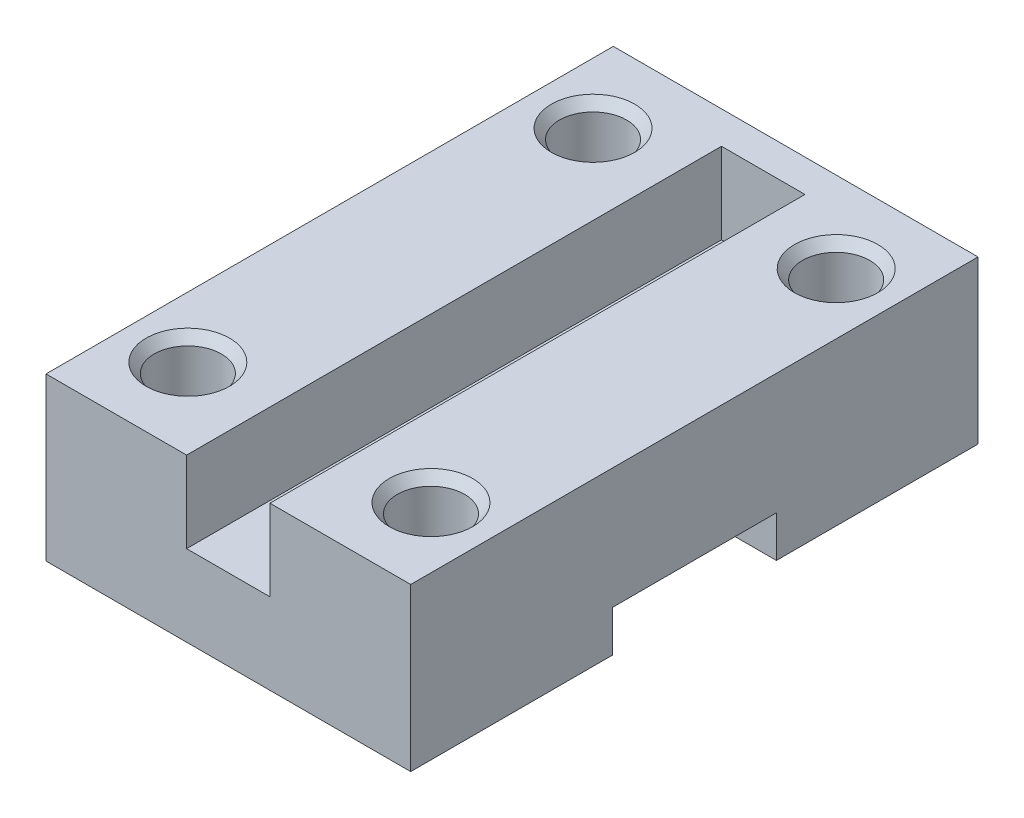
ISO-10303-21;
HEADER;
FILE_DESCRIPTION(('STEP AP214'),'2;1');
FILE_NAME('part.step','',(''),(''),'','','');
FILE_SCHEMA(('AUTOMOTIVE_DESIGN { 1 0 10303 214 1 1 1 1 }'));
ENDSEC;
DATA;
#1=APPLICATION_CONTEXT('core data for automotive mechanical design processes');
#2=APPLICATION_PROTOCOL_DEFINITION('international standard','automotive_design',2000,#1);
#3=PRODUCT_CONTEXT('',#1,'mechanical');
#4=PRODUCT('Part','Part','',(#3));
#5=PRODUCT_RELATED_PRODUCT_CATEGORY('part','',(#4));
#6=PRODUCT_DEFINITION_FORMATION('','',#4);
#7=PRODUCT_DEFINITION_CONTEXT('part definition',#1,'design');
#8=PRODUCT_DEFINITION('design','',#6,#7);
#9=PRODUCT_DEFINITION_SHAPE('','',#8);
#10=(LENGTH_UNIT() NAMED_UNIT(*) SI_UNIT(.MILLI.,.METRE.));
#11=(NAMED_UNIT(*) PLANE_ANGLE_UNIT() SI_UNIT($,.RADIAN.));
#12=(NAMED_UNIT(*) SI_UNIT($,.STERADIAN.) SOLID_ANGLE_UNIT());
#13=UNCERTAINTY_MEASURE_WITH_UNIT(LENGTH_MEASURE(1.E-05),#10,'distance_accuracy_value','');
#14=(GEOMETRIC_REPRESENTATION_CONTEXT(3) GLOBAL_UNCERTAINTY_ASSIGNED_CONTEXT((#13)) GLOBAL_UNIT_ASSIGNED_CONTEXT((#10,
#11,#12)) REPRESENTATION_CONTEXT('',''));
#15=CARTESIAN_POINT('',(0.,0.,0.));
#16=DIRECTION('',(0.,0.,1.));
#17=DIRECTION('',(1.,0.,0.));
#18=AXIS2_PLACEMENT_3D('',#15,#16,#17);
#19=CARTESIAN_POINT('',(0.,0.,0.));
#20=DIRECTION('',(0.,1.,0.));
#21=DIRECTION('',(0.,0.,1.));
#22=AXIS2_PLACEMENT_3D('',#19,#20,#21);
#23=PLANE('',#22);
#24=CARTESIAN_POINT('',(-15.,0.,25.));
#25=DIRECTION('',(0.,-1.,0.));
#26=DIRECTION('',(0.,0.,-1.));
#27=AXIS2_PLACEMENT_3D('',#24,#25,#26);
#28=CIRCLE('',#27,4.15);
#29=CARTESIAN_POINT('',(-15.,0.,20.85));
#30=VERTEX_POINT('',#29);
#31=EDGE_CURVE('E193',#30,#30,#28,.T.);
#32=ORIENTED_EDGE('',*,*,#31,.F.);
#33=EDGE_LOOP('',(#32));
#34=FACE_BOUND('',#33,.T.);
#35=CARTESIAN_POINT('',(15.,0.,25.));
#36=DIRECTION('',(0.,-1.,0.));
#37=DIRECTION('',(0.,0.,-1.));
#38=AXIS2_PLACEMENT_3D('',#35,#36,#37);
#39=CIRCLE('',#38,4.15);
#40=CARTESIAN_POINT('',(15.,0.,20.85));
#41=VERTEX_POINT('',#40);
#42=EDGE_CURVE('E197',#41,#41,#39,.T.);
#43=ORIENTED_EDGE('',*,*,#42,.F.);
#44=EDGE_LOOP('',(#43));
#45=FACE_BOUND('',#44,.T.);
#46=DIRECTION('',(0.,0.,1.));
#47=VECTOR('',#46,1.);
#48=CARTESIAN_POINT('',(-22.5,0.,35.));
#49=LINE('',#48,#47);
#50=CARTESIAN_POINT('',(-22.5,0.,10.125));
#51=VERTEX_POINT('',#50);
#52=CARTESIAN_POINT('',(-22.5,0.,35.));
#53=VERTEX_POINT('',#52);
#54=EDGE_CURVE('E229',#51,#53,#49,.T.);
#55=ORIENTED_EDGE('',*,*,#54,.F.);
#56=DIRECTION('',(1.,0.,0.));
#57=VECTOR('',#56,1.);
#58=CARTESIAN_POINT('',(-22.5,0.,10.125));
#59=LINE('',#58,#57);
#60=CARTESIAN_POINT('',(22.5,0.,10.125));
#61=VERTEX_POINT('',#60);
#62=EDGE_CURVE('E212',#51,#61,#59,.T.);
#63=ORIENTED_EDGE('',*,*,#62,.T.);
#64=DIRECTION('',(0.,0.,-1.));
#65=VECTOR('',#64,1.);
#66=CARTESIAN_POINT('',(22.5,0.,35.));
#67=LINE('',#66,#65);
#68=CARTESIAN_POINT('',(22.5,0.,35.));
#69=VERTEX_POINT('',#68);
#70=EDGE_CURVE('E236',#69,#61,#67,.T.);
#71=ORIENTED_EDGE('',*,*,#70,.F.);
#72=DIRECTION('',(1.,0.,0.));
#73=VECTOR('',#72,1.);
#74=CARTESIAN_POINT('',(22.5,0.,35.));
#75=LINE('',#74,#73);
#76=EDGE_CURVE('E233',#53,#69,#75,.T.);
#77=ORIENTED_EDGE('',*,*,#76,.F.);
#78=EDGE_LOOP('',(#55,#63,#71,#77));
#79=FACE_BOUND('',#78,.T.);
#80=ADVANCED_FACE('F34',(#34,#45,#79),#23,.F.);
#81=CARTESIAN_POINT('',(-22.5,10.,35.));
#82=DIRECTION('',(1.,0.,0.));
#83=DIRECTION('',(0.,0.,-1.));
#84=AXIS2_PLACEMENT_3D('',#81,#82,#83);
#85=PLANE('',#84);
#86=DIRECTION('',(0.,0.,1.));
#87=VECTOR('',#86,1.);
#88=CARTESIAN_POINT('',(-22.5,5.10000000000001,-10.125));
#89=LINE('',#88,#87);
#90=CARTESIAN_POINT('',(-22.5,5.10000000000001,-10.125));
#91=VERTEX_POINT('',#90);
#92=CARTESIAN_POINT('',(-22.5,5.1,10.125));
#93=VERTEX_POINT('',#92);
#94=EDGE_CURVE('E210',#91,#93,#89,.T.);
#95=ORIENTED_EDGE('',*,*,#94,.T.);
#96=DIRECTION('',(0.,-1.,0.));
#97=VECTOR('',#96,1.);
#98=CARTESIAN_POINT('',(-22.5,5.1,10.125));
#99=LINE('',#98,#97);
#100=EDGE_CURVE('E204',#93,#51,#99,.T.);
#101=ORIENTED_EDGE('',*,*,#100,.T.);
#102=ORIENTED_EDGE('',*,*,#54,.T.);
#103=DIRECTION('',(0.,-1.,0.));
#104=VECTOR('',#103,1.);
#105=CARTESIAN_POINT('',(-22.5,10.,35.));
#106=LINE('',#105,#104);
#107=CARTESIAN_POINT('',(-22.5,20.,35.));
#108=VERTEX_POINT('',#107);
#109=EDGE_CURVE('E146',#108,#53,#106,.T.);
#110=ORIENTED_EDGE('',*,*,#109,.F.);
#111=DIRECTION('',(0.,0.,1.));
#112=VECTOR('',#111,1.);
#113=CARTESIAN_POINT('',(-22.5,20.,35.));
#114=LINE('',#113,#112);
#115=CARTESIAN_POINT('',(-22.5,20.,-35.));
#116=VERTEX_POINT('',#115);
#117=EDGE_CURVE('E142',#116,#108,#114,.T.);
#118=ORIENTED_EDGE('',*,*,#117,.F.);
#119=DIRECTION('',(0.,-1.,0.));
#120=VECTOR('',#119,1.);
#121=CARTESIAN_POINT('',(-22.5,10.,-35.));
#122=LINE('',#121,#120);
#123=CARTESIAN_POINT('',(-22.5,0.,-35.));
#124=VERTEX_POINT('',#123);
#125=EDGE_CURVE('E127',#116,#124,#122,.T.);
#126=ORIENTED_EDGE('',*,*,#125,.T.);
#127=CARTESIAN_POINT('',(-22.5,0.,-10.125));
#128=VERTEX_POINT('',#127);
#129=EDGE_CURVE('E231',#124,#128,#49,.T.);
#130=ORIENTED_EDGE('',*,*,#129,.T.);
#131=DIRECTION('',(0.,1.,0.));
#132=VECTOR('',#131,1.);
#133=CARTESIAN_POINT('',(-22.5,5.10000000000001,-10.125));
#134=LINE('',#133,#132);
#135=EDGE_CURVE('E207',#128,#91,#134,.T.);
#136=ORIENTED_EDGE('',*,*,#135,.T.);
#137=EDGE_LOOP('',(#95,#101,#102,#110,#118,#126,#130,#136));
#138=FACE_BOUND('',#137,.T.);
#139=ADVANCED_FACE('F144',(#138),#85,.F.);
#140=CARTESIAN_POINT('',(22.5,10.,35.));
#141=DIRECTION('',(0.,0.,-1.));
#142=DIRECTION('',(-1.,0.,0.));
#143=AXIS2_PLACEMENT_3D('',#140,#141,#142);
#144=PLANE('',#143);
#145=ORIENTED_EDGE('',*,*,#76,.T.);
#146=DIRECTION('',(0.,-1.,0.));
#147=VECTOR('',#146,1.);
#148=CARTESIAN_POINT('',(22.5,10.,35.));
#149=LINE('',#148,#147);
#150=CARTESIAN_POINT('',(22.5,20.,35.));
#151=VERTEX_POINT('',#150);
#152=EDGE_CURVE('E241',#151,#69,#149,.T.);
#153=ORIENTED_EDGE('',*,*,#152,.F.);
#154=DIRECTION('',(1.,0.,0.));
#155=VECTOR('',#154,1.);
#156=CARTESIAN_POINT('',(5.15,20.,35.));
#157=LINE('',#156,#155);
#158=CARTESIAN_POINT('',(5.15,20.,35.));
#159=VERTEX_POINT('',#158);
#160=EDGE_CURVE('E168',#159,#151,#157,.T.);
#161=ORIENTED_EDGE('',*,*,#160,.F.);
#162=DIRECTION('',(0.,-1.,0.));
#163=VECTOR('',#162,1.);
#164=CARTESIAN_POINT('',(5.15,20.,35.));
#165=LINE('',#164,#163);
#166=CARTESIAN_POINT('',(5.15,10.,35.));
#167=VERTEX_POINT('',#166);
#168=EDGE_CURVE('E171',#159,#167,#165,.T.);
#169=ORIENTED_EDGE('',*,*,#168,.T.);
#170=DIRECTION('',(1.,0.,0.));
#171=VECTOR('',#170,1.);
#172=CARTESIAN_POINT('',(22.5,10.,35.));
#173=LINE('',#172,#171);
#174=CARTESIAN_POINT('',(-5.15,10.,35.));
#175=VERTEX_POINT('',#174);
#176=EDGE_CURVE('E139',#175,#167,#173,.T.);
#177=ORIENTED_EDGE('',*,*,#176,.F.);
#178=DIRECTION('',(0.,-1.,0.));
#179=VECTOR('',#178,1.);
#180=CARTESIAN_POINT('',(-5.15,20.,35.));
#181=LINE('',#180,#179);
#182=CARTESIAN_POINT('',(-5.15,20.,35.));
#183=VERTEX_POINT('',#182);
#184=EDGE_CURVE('E189',#183,#175,#181,.T.);
#185=ORIENTED_EDGE('',*,*,#184,.F.);
#186=DIRECTION('',(1.,0.,0.));
#187=VECTOR('',#186,1.);
#188=CARTESIAN_POINT('',(-5.15,20.,35.));
#189=LINE('',#188,#187);
#190=EDGE_CURVE('E149',#108,#183,#189,.T.);
#191=ORIENTED_EDGE('',*,*,#190,.F.);
#192=ORIENTED_EDGE('',*,*,#109,.T.);
#193=EDGE_LOOP('',(#145,#153,#161,#169,#177,#185,#191,#192));
#194=FACE_BOUND('',#193,.T.);
#195=ADVANCED_FACE('F291',(#194),#144,.F.);
#196=CARTESIAN_POINT('',(22.5,10.,35.));
#197=DIRECTION('',(-1.,0.,0.));
#198=DIRECTION('',(0.,0.,1.));
#199=AXIS2_PLACEMENT_3D('',#196,#197,#198);
#200=PLANE('',#199);
#201=ORIENTED_EDGE('',*,*,#70,.T.);
#202=DIRECTION('',(0.,1.,0.));
#203=VECTOR('',#202,1.);
#204=CARTESIAN_POINT('',(22.5,10.,10.125));
#205=LINE('',#204,#203);
#206=CARTESIAN_POINT('',(22.5,5.1,10.125));
#207=VERTEX_POINT('',#206);
#208=EDGE_CURVE('E226',#61,#207,#205,.T.);
#209=ORIENTED_EDGE('',*,*,#208,.T.);
#210=DIRECTION('',(0.,0.,-1.));
#211=VECTOR('',#210,1.);
#212=CARTESIAN_POINT('',(22.5,5.1,35.));
#213=LINE('',#212,#211);
#214=CARTESIAN_POINT('',(22.5,5.10000000000001,-10.125));
#215=VERTEX_POINT('',#214);
#216=EDGE_CURVE('E245',#207,#215,#213,.T.);
#217=ORIENTED_EDGE('',*,*,#216,.T.);
#218=DIRECTION('',(0.,-1.,0.));
#219=VECTOR('',#218,1.);
#220=CARTESIAN_POINT('',(22.5,9.99999999999997,-10.125));
#221=LINE('',#220,#219);
#222=CARTESIAN_POINT('',(22.5,0.,-10.125));
#223=VERTEX_POINT('',#222);
#224=EDGE_CURVE('E216',#215,#223,#221,.T.);
#225=ORIENTED_EDGE('',*,*,#224,.T.);
#226=CARTESIAN_POINT('',(22.5,0.,-35.));
#227=VERTEX_POINT('',#226);
#228=EDGE_CURVE('E235',#223,#227,#67,.T.);
#229=ORIENTED_EDGE('',*,*,#228,.T.);
#230=DIRECTION('',(0.,-1.,0.));
#231=VECTOR('',#230,1.);
#232=CARTESIAN_POINT('',(22.5,10.,-35.));
#233=LINE('',#232,#231);
#234=CARTESIAN_POINT('',(22.5,20.,-35.));
#235=VERTEX_POINT('',#234);
#236=EDGE_CURVE('E138',#235,#227,#233,.T.);
#237=ORIENTED_EDGE('',*,*,#236,.F.);
#238=DIRECTION('',(0.,0.,-1.));
#239=VECTOR('',#238,1.);
#240=CARTESIAN_POINT('',(22.5,20.,35.));
#241=LINE('',#240,#239);
#242=EDGE_CURVE('E155',#151,#235,#241,.T.);
#243=ORIENTED_EDGE('',*,*,#242,.F.);
#244=ORIENTED_EDGE('',*,*,#152,.T.);
#245=EDGE_LOOP('',(#201,#209,#217,#225,#229,#237,#243,#244));
#246=FACE_BOUND('',#245,.T.);
#247=ADVANCED_FACE('F315',(#246),#200,.F.);
#248=CARTESIAN_POINT('',(22.5,10.,-35.));
#249=DIRECTION('',(0.,0.,1.));
#250=DIRECTION('',(1.,0.,0.));
#251=AXIS2_PLACEMENT_3D('',#248,#249,#250);
#252=PLANE('',#251);
#253=DIRECTION('',(-1.,0.,0.));
#254=VECTOR('',#253,1.);
#255=CARTESIAN_POINT('',(22.5,0.,-35.));
#256=LINE('',#255,#254);
#257=EDGE_CURVE('E134',#227,#124,#256,.T.);
#258=ORIENTED_EDGE('',*,*,#257,.T.);
#259=ORIENTED_EDGE('',*,*,#125,.F.);
#260=DIRECTION('',(-1.,0.,0.));
#261=VECTOR('',#260,1.);
#262=CARTESIAN_POINT('',(-22.5,20.,-35.));
#263=LINE('',#262,#261);
#264=EDGE_CURVE('E132',#235,#116,#263,.T.);
#265=ORIENTED_EDGE('',*,*,#264,.F.);
#266=ORIENTED_EDGE('',*,*,#236,.T.);
#267=EDGE_LOOP('',(#258,#259,#265,#266));
#268=FACE_BOUND('',#267,.T.);
#269=ADVANCED_FACE('F129',(#268),#252,.F.);
#270=CARTESIAN_POINT('',(0.,10.,0.));
#271=DIRECTION('',(0.,1.,0.));
#272=DIRECTION('',(0.,0.,1.));
#273=AXIS2_PLACEMENT_3D('',#270,#271,#272);
#274=PLANE('',#273);
#275=DIRECTION('',(0.363344208928321,0.,0.93165497145577));
#276=VECTOR('',#275,1.);
#277=CARTESIAN_POINT('',(5.15,10.,35.));
#278=LINE('',#277,#276);
#279=CARTESIAN_POINT('',(5.13022934751461,10.,34.9493058476664));
#280=VERTEX_POINT('',#279);
#281=EDGE_CURVE('E49',#280,#167,#278,.T.);
#282=ORIENTED_EDGE('',*,*,#281,.F.);
#283=DIRECTION('',(-0.000299785590505607,0.,0.999999955064299));
#284=VECTOR('',#283,1.);
#285=CARTESIAN_POINT('',(5.15,10.,-31.));
#286=LINE('',#285,#284);
#287=CARTESIAN_POINT('',(5.15,10.,-31.));
#288=VERTEX_POINT('',#287);
#289=EDGE_CURVE('E53',#288,#280,#286,.T.);
#290=ORIENTED_EDGE('',*,*,#289,.F.);
#291=DIRECTION('',(1.,0.,0.));
#292=VECTOR('',#291,1.);
#293=CARTESIAN_POINT('',(-5.15,10.,-31.));
#294=LINE('',#293,#292);
#295=CARTESIAN_POINT('',(-5.15,10.,-31.));
#296=VERTEX_POINT('',#295);
#297=EDGE_CURVE('E175',#296,#288,#294,.T.);
#298=ORIENTED_EDGE('',*,*,#297,.F.);
#299=DIRECTION('',(0.,0.,-1.));
#300=VECTOR('',#299,1.);
#301=CARTESIAN_POINT('',(-5.15,10.,35.));
#302=LINE('',#301,#300);
#303=EDGE_CURVE('E172',#175,#296,#302,.T.);
#304=ORIENTED_EDGE('',*,*,#303,.F.);
#305=ORIENTED_EDGE('',*,*,#176,.T.);
#306=EDGE_LOOP('',(#282,#290,#298,#304,#305));
#307=FACE_BOUND('',#306,.T.);
#308=ADVANCED_FACE('F299',(#307),#274,.T.);
#309=CARTESIAN_POINT('',(15.,0.,-25.));
#310=DIRECTION('',(0.,-1.,0.));
#311=DIRECTION('',(0.,0.,-1.));
#312=AXIS2_PLACEMENT_3D('',#309,#310,#311);
#313=CIRCLE('',#312,4.15);
#314=CARTESIAN_POINT('',(15.,0.,-29.15));
#315=VERTEX_POINT('',#314);
#316=EDGE_CURVE('E192',#315,#315,#313,.T.);
#317=ORIENTED_EDGE('',*,*,#316,.F.);
#318=EDGE_LOOP('',(#317));
#319=FACE_BOUND('',#318,.T.);
#320=CARTESIAN_POINT('',(-15.,0.,-25.));
#321=DIRECTION('',(0.,-1.,0.));
#322=DIRECTION('',(0.,0.,-1.));
#323=AXIS2_PLACEMENT_3D('',#320,#321,#322);
#324=CIRCLE('',#323,4.15);
#325=CARTESIAN_POINT('',(-15.,0.,-29.15));
#326=VERTEX_POINT('',#325);
#327=EDGE_CURVE('E196',#326,#326,#324,.T.);
#328=ORIENTED_EDGE('',*,*,#327,.F.);
#329=EDGE_LOOP('',(#328));
#330=FACE_BOUND('',#329,.T.);
#331=ORIENTED_EDGE('',*,*,#228,.F.);
#332=DIRECTION('',(1.,0.,0.));
#333=VECTOR('',#332,1.);
#334=CARTESIAN_POINT('',(-22.5,0.,-10.125));
#335=LINE('',#334,#333);
#336=EDGE_CURVE('E220',#128,#223,#335,.T.);
#337=ORIENTED_EDGE('',*,*,#336,.F.);
#338=ORIENTED_EDGE('',*,*,#129,.F.);
#339=ORIENTED_EDGE('',*,*,#257,.F.);
#340=EDGE_LOOP('',(#331,#337,#338,#339));
#341=FACE_BOUND('',#340,.T.);
#342=ADVANCED_FACE('F287',(#319,#330,#341),#23,.F.);
#343=CARTESIAN_POINT('',(-22.5,5.10000000000001,-10.125));
#344=DIRECTION('',(0.,1.,0.));
#345=DIRECTION('',(0.,0.,1.));
#346=AXIS2_PLACEMENT_3D('',#343,#344,#345);
#347=PLANE('',#346);
#348=DIRECTION('',(1.,0.,0.));
#349=VECTOR('',#348,1.);
#350=CARTESIAN_POINT('',(-22.5,5.1,10.125));
#351=LINE('',#350,#349);
#352=EDGE_CURVE('E213',#93,#207,#351,.T.);
#353=ORIENTED_EDGE('',*,*,#352,.F.);
#354=ORIENTED_EDGE('',*,*,#94,.F.);
#355=DIRECTION('',(1.,0.,0.));
#356=VECTOR('',#355,1.);
#357=CARTESIAN_POINT('',(-22.5,5.10000000000001,-10.125));
#358=LINE('',#357,#356);
#359=EDGE_CURVE('E217',#91,#215,#358,.T.);
#360=ORIENTED_EDGE('',*,*,#359,.T.);
#361=ORIENTED_EDGE('',*,*,#216,.F.);
#362=EDGE_LOOP('',(#353,#354,#360,#361));
#363=FACE_BOUND('',#362,.T.);
#364=ADVANCED_FACE('F298',(#363),#347,.F.);
#365=CARTESIAN_POINT('',(-22.5,5.1,10.125));
#366=DIRECTION('',(0.,0.,1.));
#367=DIRECTION('',(1.,0.,0.));
#368=AXIS2_PLACEMENT_3D('',#365,#366,#367);
#369=PLANE('',#368);
#370=ORIENTED_EDGE('',*,*,#62,.F.);
#371=ORIENTED_EDGE('',*,*,#100,.F.);
#372=ORIENTED_EDGE('',*,*,#352,.T.);
#373=ORIENTED_EDGE('',*,*,#208,.F.);
#374=EDGE_LOOP('',(#370,#371,#372,#373));
#375=FACE_BOUND('',#374,.T.);
#376=ADVANCED_FACE('F305',(#375),#369,.F.);
#377=CARTESIAN_POINT('',(-22.5,5.10000000000001,-10.125));
#378=DIRECTION('',(0.,0.,-1.));
#379=DIRECTION('',(0.,1.,0.));
#380=AXIS2_PLACEMENT_3D('',#377,#378,#379);
#381=PLANE('',#380);
#382=ORIENTED_EDGE('',*,*,#359,.F.);
#383=ORIENTED_EDGE('',*,*,#135,.F.);
#384=ORIENTED_EDGE('',*,*,#336,.T.);
#385=ORIENTED_EDGE('',*,*,#224,.F.);
#386=EDGE_LOOP('',(#382,#383,#384,#385));
#387=FACE_BOUND('',#386,.T.);
#388=ADVANCED_FACE('F317',(#387),#381,.F.);
#389=CARTESIAN_POINT('',(-15.,10.,-25.));
#390=DIRECTION('',(0.,-1.,0.));
#391=DIRECTION('',(0.,0.,-1.));
#392=AXIS2_PLACEMENT_3D('',#389,#390,#391);
#393=CYLINDRICAL_SURFACE('',#392,4.15);
#394=CARTESIAN_POINT('',(-15.,18.8082464074058,-25.));
#395=DIRECTION('',(0.,1.,0.));
#396=DIRECTION('',(0.,0.,1.));
#397=AXIS2_PLACEMENT_3D('',#394,#395,#396);
#398=CIRCLE('',#397,4.15);
#399=CARTESIAN_POINT('',(-15.,18.8082464074058,-20.85));
#400=VERTEX_POINT('',#399);
#401=EDGE_CURVE('E42',#400,#400,#398,.T.);
#402=ORIENTED_EDGE('',*,*,#401,.T.);
#403=EDGE_LOOP('',(#402));
#404=FACE_BOUND('',#403,.T.);
#405=ORIENTED_EDGE('',*,*,#327,.T.);
#406=EDGE_LOOP('',(#405));
#407=FACE_BOUND('',#406,.T.);
#408=ADVANCED_FACE('F268',(#404,#407),#393,.F.);
#409=CARTESIAN_POINT('',(15.,10.,-25.));
#410=DIRECTION('',(0.,-1.,0.));
#411=DIRECTION('',(0.,0.,-1.));
#412=AXIS2_PLACEMENT_3D('',#409,#410,#411);
#413=CYLINDRICAL_SURFACE('',#412,4.15);
#414=CARTESIAN_POINT('',(15.,18.8082464074058,-25.));
#415=DIRECTION('',(0.,1.,0.));
#416=DIRECTION('',(0.,0.,1.));
#417=AXIS2_PLACEMENT_3D('',#414,#415,#416);
#418=CIRCLE('',#417,4.15);
#419=CARTESIAN_POINT('',(15.,18.8082464074058,-20.85));
#420=VERTEX_POINT('',#419);
#421=EDGE_CURVE('E11',#420,#420,#418,.T.);
#422=ORIENTED_EDGE('',*,*,#421,.T.);
#423=EDGE_LOOP('',(#422));
#424=FACE_BOUND('',#423,.T.);
#425=ORIENTED_EDGE('',*,*,#316,.T.);
#426=EDGE_LOOP('',(#425));
#427=FACE_BOUND('',#426,.T.);
#428=ADVANCED_FACE('F354',(#424,#427),#413,.F.);
#429=CARTESIAN_POINT('',(15.,10.,25.));
#430=DIRECTION('',(0.,-1.,0.));
#431=DIRECTION('',(0.,0.,-1.));
#432=AXIS2_PLACEMENT_3D('',#429,#430,#431);
#433=CYLINDRICAL_SURFACE('',#432,4.15);
#434=CARTESIAN_POINT('',(15.,18.8082464074058,25.));
#435=DIRECTION('',(0.,1.,0.));
#436=DIRECTION('',(0.,0.,1.));
#437=AXIS2_PLACEMENT_3D('',#434,#435,#436);
#438=CIRCLE('',#437,4.15);
#439=CARTESIAN_POINT('',(15.,18.8082464074058,29.15));
#440=VERTEX_POINT('',#439);
#441=EDGE_CURVE('E248',#440,#440,#438,.T.);
#442=ORIENTED_EDGE('',*,*,#441,.T.);
#443=EDGE_LOOP('',(#442));
#444=FACE_BOUND('',#443,.T.);
#445=ORIENTED_EDGE('',*,*,#42,.T.);
#446=EDGE_LOOP('',(#445));
#447=FACE_BOUND('',#446,.T.);
#448=ADVANCED_FACE('F357',(#444,#447),#433,.F.);
#449=CARTESIAN_POINT('',(-15.,10.,25.));
#450=DIRECTION('',(0.,-1.,0.));
#451=DIRECTION('',(0.,0.,-1.));
#452=AXIS2_PLACEMENT_3D('',#449,#450,#451);
#453=CYLINDRICAL_SURFACE('',#452,4.15);
#454=CARTESIAN_POINT('',(-15.,18.8082464074058,25.));
#455=DIRECTION('',(0.,1.,0.));
#456=DIRECTION('',(0.,0.,1.));
#457=AXIS2_PLACEMENT_3D('',#454,#455,#456);
#458=CIRCLE('',#457,4.15);
#459=CARTESIAN_POINT('',(-15.,18.8082464074058,29.15));
#460=VERTEX_POINT('',#459);
#461=EDGE_CURVE('E263',#460,#460,#458,.T.);
#462=ORIENTED_EDGE('',*,*,#461,.T.);
#463=EDGE_LOOP('',(#462));
#464=FACE_BOUND('',#463,.T.);
#465=ORIENTED_EDGE('',*,*,#31,.T.);
#466=EDGE_LOOP('',(#465));
#467=FACE_BOUND('',#466,.T.);
#468=ADVANCED_FACE('F361',(#464,#467),#453,.F.);
#469=CARTESIAN_POINT('',(0.,20.,0.));
#470=DIRECTION('',(0.,1.,0.));
#471=DIRECTION('',(0.,0.,1.));
#472=AXIS2_PLACEMENT_3D('',#469,#470,#471);
#473=PLANE('',#472);
#474=CARTESIAN_POINT('',(15.,20.,25.));
#475=DIRECTION('',(0.,1.,0.));
#476=DIRECTION('',(0.,0.,1.));
#477=AXIS2_PLACEMENT_3D('',#474,#475,#476);
#478=CIRCLE('',#477,5.15000000000002);
#479=CARTESIAN_POINT('',(15.,20.,30.15));
#480=VERTEX_POINT('',#479);
#481=EDGE_CURVE('E260',#480,#480,#478,.F.);
#482=ORIENTED_EDGE('',*,*,#481,.T.);
#483=EDGE_LOOP('',(#482));
#484=FACE_BOUND('',#483,.T.);
#485=CARTESIAN_POINT('',(-15.,20.,25.));
#486=DIRECTION('',(0.,1.,0.));
#487=DIRECTION('',(0.,0.,1.));
#488=AXIS2_PLACEMENT_3D('',#485,#486,#487);
#489=CIRCLE('',#488,5.15000000000002);
#490=CARTESIAN_POINT('',(-15.,20.,30.15));
#491=VERTEX_POINT('',#490);
#492=EDGE_CURVE('E257',#491,#491,#489,.F.);
#493=ORIENTED_EDGE('',*,*,#492,.T.);
#494=EDGE_LOOP('',(#493));
#495=FACE_BOUND('',#494,.T.);
#496=CARTESIAN_POINT('',(-15.,20.,-25.));
#497=DIRECTION('',(0.,1.,0.));
#498=DIRECTION('',(0.,0.,1.));
#499=AXIS2_PLACEMENT_3D('',#496,#497,#498);
#500=CIRCLE('',#499,5.15000000000002);
#501=CARTESIAN_POINT('',(-15.,20.,-19.85));
#502=VERTEX_POINT('',#501);
#503=EDGE_CURVE('E254',#502,#502,#500,.F.);
#504=ORIENTED_EDGE('',*,*,#503,.T.);
#505=EDGE_LOOP('',(#504));
#506=FACE_BOUND('',#505,.T.);
#507=CARTESIAN_POINT('',(15.,20.,-25.));
#508=DIRECTION('',(0.,1.,0.));
#509=DIRECTION('',(0.,0.,1.));
#510=AXIS2_PLACEMENT_3D('',#507,#508,#509);
#511=CIRCLE('',#510,5.15000000000002);
#512=CARTESIAN_POINT('',(15.,20.,-19.85));
#513=VERTEX_POINT('',#512);
#514=EDGE_CURVE('E251',#513,#513,#511,.F.);
#515=ORIENTED_EDGE('',*,*,#514,.T.);
#516=EDGE_LOOP('',(#515));
#517=FACE_BOUND('',#516,.T.);
#518=ORIENTED_EDGE('',*,*,#264,.T.);
#519=ORIENTED_EDGE('',*,*,#117,.T.);
#520=ORIENTED_EDGE('',*,*,#190,.T.);
#521=DIRECTION('',(0.,0.,-1.));
#522=VECTOR('',#521,1.);
#523=CARTESIAN_POINT('',(-5.15,20.,35.));
#524=LINE('',#523,#522);
#525=CARTESIAN_POINT('',(-5.15,20.,-31.));
#526=VERTEX_POINT('',#525);
#527=EDGE_CURVE('E160',#183,#526,#524,.T.);
#528=ORIENTED_EDGE('',*,*,#527,.T.);
#529=DIRECTION('',(1.,0.,0.));
#530=VECTOR('',#529,1.);
#531=CARTESIAN_POINT('',(-5.15,20.,-31.));
#532=LINE('',#531,#530);
#533=CARTESIAN_POINT('',(5.15,20.,-31.));
#534=VERTEX_POINT('',#533);
#535=EDGE_CURVE('E162',#526,#534,#532,.T.);
#536=ORIENTED_EDGE('',*,*,#535,.T.);
#537=DIRECTION('',(-0.000299785590505607,0.,0.999999955064299));
#538=VECTOR('',#537,1.);
#539=CARTESIAN_POINT('',(5.15,20.,-31.));
#540=LINE('',#539,#538);
#541=CARTESIAN_POINT('',(5.13022934751461,20.,34.9493058476664));
#542=VERTEX_POINT('',#541);
#543=EDGE_CURVE('E164',#534,#542,#540,.T.);
#544=ORIENTED_EDGE('',*,*,#543,.T.);
#545=DIRECTION('',(0.363344208928321,0.,0.93165497145577));
#546=VECTOR('',#545,1.);
#547=CARTESIAN_POINT('',(5.15,20.,35.));
#548=LINE('',#547,#546);
#549=EDGE_CURVE('E166',#542,#159,#548,.T.);
#550=ORIENTED_EDGE('',*,*,#549,.T.);
#551=ORIENTED_EDGE('',*,*,#160,.T.);
#552=ORIENTED_EDGE('',*,*,#242,.T.);
#553=EDGE_LOOP('',(#518,#519,#520,#528,#536,#544,#550,#551,#552));
#554=FACE_BOUND('',#553,.T.);
#555=ADVANCED_FACE('F152',(#484,#495,#506,#517,#554),#473,.T.);
#556=CARTESIAN_POINT('',(-5.15,20.,35.));
#557=DIRECTION('',(-1.,0.,0.));
#558=DIRECTION('',(0.,0.,1.));
#559=AXIS2_PLACEMENT_3D('',#556,#557,#558);
#560=PLANE('',#559);
#561=ORIENTED_EDGE('',*,*,#303,.T.);
#562=DIRECTION('',(0.,-1.,0.));
#563=VECTOR('',#562,1.);
#564=CARTESIAN_POINT('',(-5.15,20.,-31.));
#565=LINE('',#564,#563);
#566=EDGE_CURVE('E186',#526,#296,#565,.T.);
#567=ORIENTED_EDGE('',*,*,#566,.F.);
#568=ORIENTED_EDGE('',*,*,#527,.F.);
#569=ORIENTED_EDGE('',*,*,#184,.T.);
#570=EDGE_LOOP('',(#561,#567,#568,#569));
#571=FACE_BOUND('',#570,.T.);
#572=ADVANCED_FACE('F333',(#571),#560,.F.);
#573=CARTESIAN_POINT('',(-5.15,20.,-31.));
#574=DIRECTION('',(0.,0.,-1.));
#575=DIRECTION('',(-1.,0.,0.));
#576=AXIS2_PLACEMENT_3D('',#573,#574,#575);
#577=PLANE('',#576);
#578=ORIENTED_EDGE('',*,*,#297,.T.);
#579=DIRECTION('',(0.,-1.,0.));
#580=VECTOR('',#579,1.);
#581=CARTESIAN_POINT('',(5.15,20.,-31.));
#582=LINE('',#581,#580);
#583=EDGE_CURVE('E183',#534,#288,#582,.T.);
#584=ORIENTED_EDGE('',*,*,#583,.F.);
#585=ORIENTED_EDGE('',*,*,#535,.F.);
#586=ORIENTED_EDGE('',*,*,#566,.T.);
#587=EDGE_LOOP('',(#578,#584,#585,#586));
#588=FACE_BOUND('',#587,.T.);
#589=ADVANCED_FACE('F335',(#588),#577,.F.);
#590=CARTESIAN_POINT('',(5.15,20.,-31.));
#591=DIRECTION('',(0.999999955064299,0.,0.000299785590505607));
#592=DIRECTION('',(0.000299785590505607,0.,-0.999999955064299));
#593=AXIS2_PLACEMENT_3D('',#590,#591,#592);
#594=PLANE('',#593);
#595=ORIENTED_EDGE('',*,*,#289,.T.);
#596=DIRECTION('',(0.,-1.,0.));
#597=VECTOR('',#596,1.);
#598=CARTESIAN_POINT('',(5.13022934751461,20.,34.9493058476664));
#599=LINE('',#598,#597);
#600=EDGE_CURVE('E180',#542,#280,#599,.T.);
#601=ORIENTED_EDGE('',*,*,#600,.F.);
#602=ORIENTED_EDGE('',*,*,#543,.F.);
#603=ORIENTED_EDGE('',*,*,#583,.T.);
#604=EDGE_LOOP('',(#595,#601,#602,#603));
#605=FACE_BOUND('',#604,.T.);
#606=ADVANCED_FACE('F339',(#605),#594,.F.);
#607=CARTESIAN_POINT('',(5.15,20.,35.));
#608=DIRECTION('',(0.93165497145577,0.,-0.363344208928321));
#609=DIRECTION('',(-0.363344208928321,0.,-0.93165497145577));
#610=AXIS2_PLACEMENT_3D('',#607,#608,#609);
#611=PLANE('',#610);
#612=ORIENTED_EDGE('',*,*,#281,.T.);
#613=ORIENTED_EDGE('',*,*,#168,.F.);
#614=ORIENTED_EDGE('',*,*,#549,.F.);
#615=ORIENTED_EDGE('',*,*,#600,.T.);
#616=EDGE_LOOP('',(#612,#613,#614,#615));
#617=FACE_BOUND('',#616,.T.);
#618=ADVANCED_FACE('F344',(#617),#611,.F.);
#619=CARTESIAN_POINT('',(15.,18.8082464074058,25.));
#620=DIRECTION('',(0.,1.,0.));
#621=DIRECTION('',(0.,0.,1.));
#622=AXIS2_PLACEMENT_3D('',#619,#620,#621);
#623=CONICAL_SURFACE('',#622,4.15,0.698131700797737);
#624=ORIENTED_EDGE('',*,*,#481,.F.);
#625=EDGE_LOOP('',(#624));
#626=FACE_BOUND('',#625,.T.);
#627=ORIENTED_EDGE('',*,*,#441,.F.);
#628=EDGE_LOOP('',(#627));
#629=FACE_BOUND('',#628,.T.);
#630=ADVANCED_FACE('F280',(#626,#629),#623,.F.);
#631=CARTESIAN_POINT('',(-15.,18.8082464074058,25.));
#632=DIRECTION('',(0.,1.,0.));
#633=DIRECTION('',(0.,0.,1.));
#634=AXIS2_PLACEMENT_3D('',#631,#632,#633);
#635=CONICAL_SURFACE('',#634,4.15,0.698131700797737);
#636=ORIENTED_EDGE('',*,*,#492,.F.);
#637=EDGE_LOOP('',(#636));
#638=FACE_BOUND('',#637,.T.);
#639=ORIENTED_EDGE('',*,*,#461,.F.);
#640=EDGE_LOOP('',(#639));
#641=FACE_BOUND('',#640,.T.);
#642=ADVANCED_FACE('F273',(#638,#641),#635,.F.);
#643=CARTESIAN_POINT('',(-15.,18.8082464074058,-25.));
#644=DIRECTION('',(0.,1.,0.));
#645=DIRECTION('',(0.,0.,1.));
#646=AXIS2_PLACEMENT_3D('',#643,#644,#645);
#647=CONICAL_SURFACE('',#646,4.15,0.698131700797737);
#648=ORIENTED_EDGE('',*,*,#503,.F.);
#649=EDGE_LOOP('',(#648));
#650=FACE_BOUND('',#649,.T.);
#651=ORIENTED_EDGE('',*,*,#401,.F.);
#652=EDGE_LOOP('',(#651));
#653=FACE_BOUND('',#652,.T.);
#654=ADVANCED_FACE('F271',(#650,#653),#647,.F.);
#655=CARTESIAN_POINT('',(15.,18.8082464074058,-25.));
#656=DIRECTION('',(0.,1.,0.));
#657=DIRECTION('',(0.,0.,1.));
#658=AXIS2_PLACEMENT_3D('',#655,#656,#657);
#659=CONICAL_SURFACE('',#658,4.15,0.698131700797737);
#660=ORIENTED_EDGE('',*,*,#514,.F.);
#661=EDGE_LOOP('',(#660));
#662=FACE_BOUND('',#661,.T.);
#663=ORIENTED_EDGE('',*,*,#421,.F.);
#664=EDGE_LOOP('',(#663));
#665=FACE_BOUND('',#664,.T.);
#666=ADVANCED_FACE('F36',(#662,#665),#659,.F.);
#667=CLOSED_SHELL('',(#80,#139,#195,#247,#269,#308,#342,#364,#376,#388,#408,#428,#448,#468,#555,
#572,#589,#606,#618,#630,#642,#654,#666));
#668=MANIFOLD_SOLID_BREP('B2',#667);
#669=ADVANCED_BREP_SHAPE_REPRESENTATION('',(#18,#668),#14);
#670=SHAPE_DEFINITION_REPRESENTATION(#9,#669);
ENDSEC;
END-ISO-10303-21;
